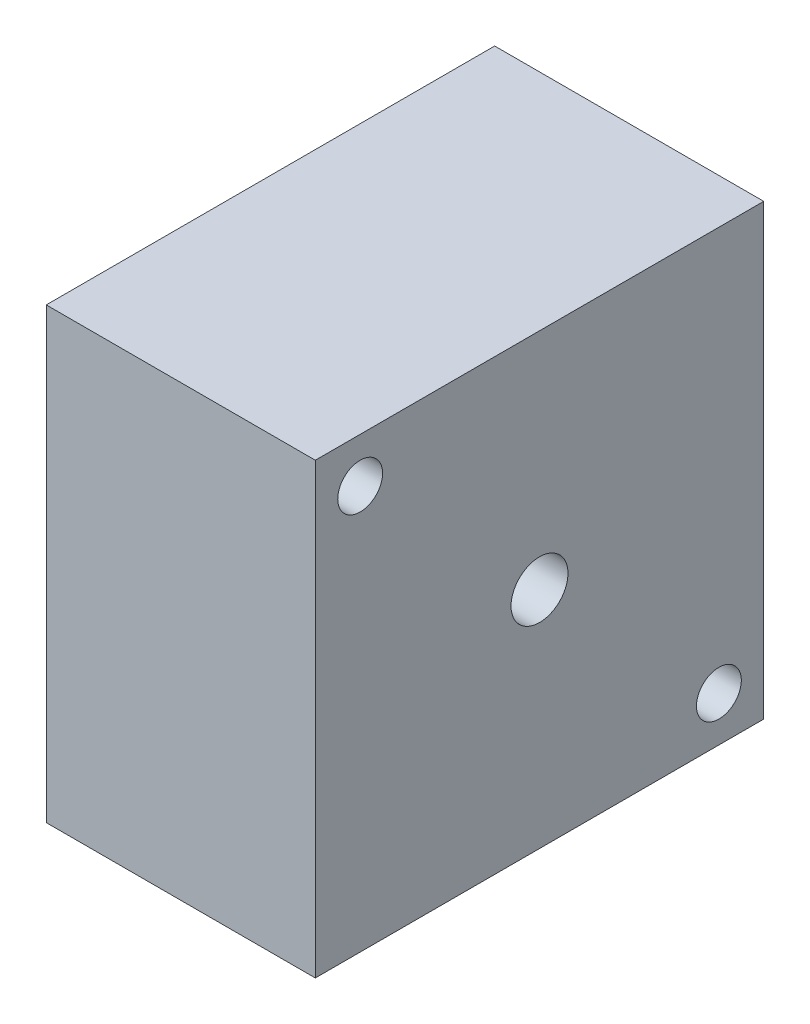
ISO-10303-21;
HEADER;
FILE_DESCRIPTION(('STEP AP214'),'2;1');
FILE_NAME('part.step','',(''),(''),'','','');
FILE_SCHEMA(('AUTOMOTIVE_DESIGN { 1 0 10303 214 1 1 1 1 }'));
ENDSEC;
DATA;
#1=APPLICATION_CONTEXT('core data for automotive mechanical design processes');
#2=APPLICATION_PROTOCOL_DEFINITION('international standard','automotive_design',2000,#1);
#3=PRODUCT_CONTEXT('',#1,'mechanical');
#4=PRODUCT('Part','Part','',(#3));
#5=PRODUCT_RELATED_PRODUCT_CATEGORY('part','',(#4));
#6=PRODUCT_DEFINITION_FORMATION('','',#4);
#7=PRODUCT_DEFINITION_CONTEXT('part definition',#1,'design');
#8=PRODUCT_DEFINITION('design','',#6,#7);
#9=PRODUCT_DEFINITION_SHAPE('','',#8);
#10=(LENGTH_UNIT() NAMED_UNIT(*) SI_UNIT(.MILLI.,.METRE.));
#11=(NAMED_UNIT(*) PLANE_ANGLE_UNIT() SI_UNIT($,.RADIAN.));
#12=(NAMED_UNIT(*) SI_UNIT($,.STERADIAN.) SOLID_ANGLE_UNIT());
#13=UNCERTAINTY_MEASURE_WITH_UNIT(LENGTH_MEASURE(1.E-05),#10,'distance_accuracy_value','');
#14=(GEOMETRIC_REPRESENTATION_CONTEXT(3) GLOBAL_UNCERTAINTY_ASSIGNED_CONTEXT((#13)) GLOBAL_UNIT_ASSIGNED_CONTEXT((#10,
#11,#12)) REPRESENTATION_CONTEXT('',''));
#15=CARTESIAN_POINT('',(0.,0.,0.));
#16=DIRECTION('',(0.,0.,1.));
#17=DIRECTION('',(1.,0.,0.));
#18=AXIS2_PLACEMENT_3D('',#15,#16,#17);
#19=CARTESIAN_POINT('',(30.,50.,0.));
#20=DIRECTION('',(-1.,0.,0.));
#21=DIRECTION('',(0.,0.,1.));
#22=AXIS2_PLACEMENT_3D('',#19,#20,#21);
#23=PLANE('',#22);
#24=CARTESIAN_POINT('',(30.,5.00000000000007,-45.0000000000001));
#25=DIRECTION('',(-1.,0.,0.));
#26=DIRECTION('',(0.,0.,1.));
#27=AXIS2_PLACEMENT_3D('',#24,#25,#26);
#28=CIRCLE('',#27,2.5);
#29=CARTESIAN_POINT('',(30.,5.00000000000007,-42.5000000000001));
#30=VERTEX_POINT('',#29);
#31=EDGE_CURVE('E113',#30,#30,#28,.F.);
#32=ORIENTED_EDGE('',*,*,#31,.F.);
#33=EDGE_LOOP('',(#32));
#34=FACE_BOUND('',#33,.T.);
#35=DIRECTION('',(0.,-1.,0.));
#36=VECTOR('',#35,1.);
#37=CARTESIAN_POINT('',(30.,0.,0.));
#38=LINE('',#37,#36);
#39=CARTESIAN_POINT('',(30.,50.,0.));
#40=VERTEX_POINT('',#39);
#41=CARTESIAN_POINT('',(30.,0.,0.));
#42=VERTEX_POINT('',#41);
#43=EDGE_CURVE('E89',#40,#42,#38,.T.);
#44=ORIENTED_EDGE('',*,*,#43,.T.);
#45=DIRECTION('',(0.,0.,-1.));
#46=VECTOR('',#45,1.);
#47=CARTESIAN_POINT('',(30.,0.,0.));
#48=LINE('',#47,#46);
#49=CARTESIAN_POINT('',(30.,0.,-50.));
#50=VERTEX_POINT('',#49);
#51=EDGE_CURVE('E84',#42,#50,#48,.T.);
#52=ORIENTED_EDGE('',*,*,#51,.T.);
#53=DIRECTION('',(0.,1.,0.));
#54=VECTOR('',#53,1.);
#55=CARTESIAN_POINT('',(30.,0.,-50.));
#56=LINE('',#55,#54);
#57=CARTESIAN_POINT('',(30.,50.,-50.));
#58=VERTEX_POINT('',#57);
#59=EDGE_CURVE('E87',#50,#58,#56,.T.);
#60=ORIENTED_EDGE('',*,*,#59,.T.);
#61=DIRECTION('',(0.,0.,1.));
#62=VECTOR('',#61,1.);
#63=CARTESIAN_POINT('',(30.,50.,0.));
#64=LINE('',#63,#62);
#65=EDGE_CURVE('E54',#58,#40,#64,.T.);
#66=ORIENTED_EDGE('',*,*,#65,.T.);
#67=EDGE_LOOP('',(#44,#52,#60,#66));
#68=FACE_BOUND('',#67,.T.);
#69=CARTESIAN_POINT('',(30.,25.,-25.0000000000005));
#70=DIRECTION('',(-1.,0.,0.));
#71=DIRECTION('',(0.,0.,1.));
#72=AXIS2_PLACEMENT_3D('',#69,#70,#71);
#73=CIRCLE('',#72,3.175);
#74=CARTESIAN_POINT('',(30.,25.,-21.8250000000005));
#75=VERTEX_POINT('',#74);
#76=EDGE_CURVE('E105',#75,#75,#73,.F.);
#77=ORIENTED_EDGE('',*,*,#76,.F.);
#78=EDGE_LOOP('',(#77));
#79=FACE_BOUND('',#78,.T.);
#80=CARTESIAN_POINT('',(30.,45.,-5.00000000000006));
#81=DIRECTION('',(-1.,0.,0.));
#82=DIRECTION('',(0.,0.,1.));
#83=AXIS2_PLACEMENT_3D('',#80,#81,#82);
#84=CIRCLE('',#83,2.5);
#85=CARTESIAN_POINT('',(30.,47.4855372886238,-4.7314773997207));
#86=VERTEX_POINT('',#85);
#87=EDGE_CURVE('E116',#86,#86,#84,.F.);
#88=ORIENTED_EDGE('',*,*,#87,.F.);
#89=EDGE_LOOP('',(#88));
#90=FACE_BOUND('',#89,.T.);
#91=ADVANCED_FACE('F35',(#34,#68,#79,#90),#23,.F.);
#92=CARTESIAN_POINT('',(0.,50.,0.));
#93=DIRECTION('',(-1.,0.,0.));
#94=DIRECTION('',(0.,0.,1.));
#95=AXIS2_PLACEMENT_3D('',#92,#93,#94);
#96=PLANE('',#95);
#97=CARTESIAN_POINT('',(0.,5.00000000000007,-45.0000000000001));
#98=DIRECTION('',(-1.,0.,0.));
#99=DIRECTION('',(0.,0.,1.));
#100=AXIS2_PLACEMENT_3D('',#97,#98,#99);
#101=CIRCLE('',#100,2.5);
#102=CARTESIAN_POINT('',(0.,5.00000000000007,-42.5000000000001));
#103=VERTEX_POINT('',#102);
#104=EDGE_CURVE('E114',#103,#103,#101,.F.);
#105=ORIENTED_EDGE('',*,*,#104,.T.);
#106=EDGE_LOOP('',(#105));
#107=FACE_BOUND('',#106,.T.);
#108=DIRECTION('',(0.,-1.,0.));
#109=VECTOR('',#108,1.);
#110=CARTESIAN_POINT('',(0.,0.,0.));
#111=LINE('',#110,#109);
#112=CARTESIAN_POINT('',(0.,50.,0.));
#113=VERTEX_POINT('',#112);
#114=CARTESIAN_POINT('',(0.,0.,0.));
#115=VERTEX_POINT('',#114);
#116=EDGE_CURVE('E102',#113,#115,#111,.T.);
#117=ORIENTED_EDGE('',*,*,#116,.F.);
#118=DIRECTION('',(0.,0.,1.));
#119=VECTOR('',#118,1.);
#120=CARTESIAN_POINT('',(0.,50.,0.));
#121=LINE('',#120,#119);
#122=CARTESIAN_POINT('',(0.,50.,-50.));
#123=VERTEX_POINT('',#122);
#124=EDGE_CURVE('E77',#123,#113,#121,.T.);
#125=ORIENTED_EDGE('',*,*,#124,.F.);
#126=DIRECTION('',(0.,1.,0.));
#127=VECTOR('',#126,1.);
#128=CARTESIAN_POINT('',(0.,0.,-50.));
#129=LINE('',#128,#127);
#130=CARTESIAN_POINT('',(0.,0.,-50.));
#131=VERTEX_POINT('',#130);
#132=EDGE_CURVE('E71',#131,#123,#129,.T.);
#133=ORIENTED_EDGE('',*,*,#132,.F.);
#134=DIRECTION('',(0.,0.,-1.));
#135=VECTOR('',#134,1.);
#136=CARTESIAN_POINT('',(0.,0.,0.));
#137=LINE('',#136,#135);
#138=EDGE_CURVE('E93',#115,#131,#137,.T.);
#139=ORIENTED_EDGE('',*,*,#138,.F.);
#140=EDGE_LOOP('',(#117,#125,#133,#139));
#141=FACE_BOUND('',#140,.T.);
#142=CARTESIAN_POINT('',(0.,25.,-25.0000000000003));
#143=DIRECTION('',(-1.,0.,0.));
#144=DIRECTION('',(0.,0.,1.));
#145=AXIS2_PLACEMENT_3D('',#142,#143,#144);
#146=CIRCLE('',#145,3.175);
#147=CARTESIAN_POINT('',(0.,25.,-21.8250000000003));
#148=VERTEX_POINT('',#147);
#149=EDGE_CURVE('E111',#148,#148,#146,.F.);
#150=ORIENTED_EDGE('',*,*,#149,.T.);
#151=EDGE_LOOP('',(#150));
#152=FACE_BOUND('',#151,.T.);
#153=CARTESIAN_POINT('',(0.,45.,-5.00000000000006));
#154=DIRECTION('',(-1.,0.,0.));
#155=DIRECTION('',(0.,0.,1.));
#156=AXIS2_PLACEMENT_3D('',#153,#154,#155);
#157=CIRCLE('',#156,2.5);
#158=CARTESIAN_POINT('',(0.,47.4855372886238,-4.73147739972069));
#159=VERTEX_POINT('',#158);
#160=EDGE_CURVE('E39',#159,#159,#157,.F.);
#161=ORIENTED_EDGE('',*,*,#160,.T.);
#162=EDGE_LOOP('',(#161));
#163=FACE_BOUND('',#162,.T.);
#164=ADVANCED_FACE('F133',(#107,#141,#152,#163),#96,.T.);
#165=CARTESIAN_POINT('',(30.,0.,0.));
#166=DIRECTION('',(0.,0.,-1.));
#167=DIRECTION('',(-1.,0.,0.));
#168=AXIS2_PLACEMENT_3D('',#165,#166,#167);
#169=PLANE('',#168);
#170=ORIENTED_EDGE('',*,*,#116,.T.);
#171=DIRECTION('',(-1.,0.,0.));
#172=VECTOR('',#171,1.);
#173=CARTESIAN_POINT('',(30.,0.,0.));
#174=LINE('',#173,#172);
#175=EDGE_CURVE('E11',#42,#115,#174,.T.);
#176=ORIENTED_EDGE('',*,*,#175,.F.);
#177=ORIENTED_EDGE('',*,*,#43,.F.);
#178=DIRECTION('',(-1.,0.,0.));
#179=VECTOR('',#178,1.);
#180=CARTESIAN_POINT('',(30.,50.,0.));
#181=LINE('',#180,#179);
#182=EDGE_CURVE('E98',#40,#113,#181,.T.);
#183=ORIENTED_EDGE('',*,*,#182,.T.);
#184=EDGE_LOOP('',(#170,#176,#177,#183));
#185=FACE_BOUND('',#184,.T.);
#186=ADVANCED_FACE('F37',(#185),#169,.F.);
#187=CARTESIAN_POINT('',(30.,0.,0.));
#188=DIRECTION('',(0.,1.,0.));
#189=DIRECTION('',(0.,0.,1.));
#190=AXIS2_PLACEMENT_3D('',#187,#188,#189);
#191=PLANE('',#190);
#192=ORIENTED_EDGE('',*,*,#138,.T.);
#193=DIRECTION('',(-1.,0.,0.));
#194=VECTOR('',#193,1.);
#195=CARTESIAN_POINT('',(30.,0.,-50.));
#196=LINE('',#195,#194);
#197=EDGE_CURVE('E45',#50,#131,#196,.T.);
#198=ORIENTED_EDGE('',*,*,#197,.F.);
#199=ORIENTED_EDGE('',*,*,#51,.F.);
#200=ORIENTED_EDGE('',*,*,#175,.T.);
#201=EDGE_LOOP('',(#192,#198,#199,#200));
#202=FACE_BOUND('',#201,.T.);
#203=ADVANCED_FACE('F92',(#202),#191,.F.);
#204=CARTESIAN_POINT('',(30.,0.,-50.));
#205=DIRECTION('',(0.,0.,1.));
#206=DIRECTION('',(1.,0.,0.));
#207=AXIS2_PLACEMENT_3D('',#204,#205,#206);
#208=PLANE('',#207);
#209=ORIENTED_EDGE('',*,*,#132,.T.);
#210=DIRECTION('',(-1.,0.,0.));
#211=VECTOR('',#210,1.);
#212=CARTESIAN_POINT('',(30.,50.,-50.));
#213=LINE('',#212,#211);
#214=EDGE_CURVE('E94',#58,#123,#213,.T.);
#215=ORIENTED_EDGE('',*,*,#214,.F.);
#216=ORIENTED_EDGE('',*,*,#59,.F.);
#217=ORIENTED_EDGE('',*,*,#197,.T.);
#218=EDGE_LOOP('',(#209,#215,#216,#217));
#219=FACE_BOUND('',#218,.T.);
#220=ADVANCED_FACE('F96',(#219),#208,.F.);
#221=CARTESIAN_POINT('',(30.,50.,0.));
#222=DIRECTION('',(0.,-1.,0.));
#223=DIRECTION('',(0.,0.,-1.));
#224=AXIS2_PLACEMENT_3D('',#221,#222,#223);
#225=PLANE('',#224);
#226=ORIENTED_EDGE('',*,*,#124,.T.);
#227=ORIENTED_EDGE('',*,*,#182,.F.);
#228=ORIENTED_EDGE('',*,*,#65,.F.);
#229=ORIENTED_EDGE('',*,*,#214,.T.);
#230=EDGE_LOOP('',(#226,#227,#228,#229));
#231=FACE_BOUND('',#230,.T.);
#232=ADVANCED_FACE('F144',(#231),#225,.F.);
#233=CARTESIAN_POINT('',(-23.4630809985406,25.,-25.0000000000001));
#234=DIRECTION('',(1.,0.,0.));
#235=DIRECTION('',(0.,0.438373475942388,-0.898792910291458));
#236=AXIS2_PLACEMENT_3D('',#233,#234,#235);
#237=CYLINDRICAL_SURFACE('',#236,3.175);
#238=ORIENTED_EDGE('',*,*,#149,.F.);
#239=EDGE_LOOP('',(#238));
#240=FACE_BOUND('',#239,.T.);
#241=ORIENTED_EDGE('',*,*,#76,.T.);
#242=EDGE_LOOP('',(#241));
#243=FACE_BOUND('',#242,.T.);
#244=ADVANCED_FACE('F130',(#240,#243),#237,.F.);
#245=CARTESIAN_POINT('',(-56.4081609985396,5.00000000000007,-45.0000000000001));
#246=DIRECTION('',(1.,0.,0.));
#247=DIRECTION('',(0.,-0.0752927382838369,-0.99716147316356));
#248=AXIS2_PLACEMENT_3D('',#245,#246,#247);
#249=CYLINDRICAL_SURFACE('',#248,2.5);
#250=ORIENTED_EDGE('',*,*,#104,.F.);
#251=EDGE_LOOP('',(#250));
#252=FACE_BOUND('',#251,.T.);
#253=ORIENTED_EDGE('',*,*,#31,.T.);
#254=EDGE_LOOP('',(#253));
#255=FACE_BOUND('',#254,.T.);
#256=ADVANCED_FACE('F164',(#252,#255),#249,.F.);
#257=CARTESIAN_POINT('',(-56.4081609985406,45.,-5.00000000000004));
#258=DIRECTION('',(1.,0.,0.));
#259=DIRECTION('',(0.,0.994214915449508,0.107409040111746));
#260=AXIS2_PLACEMENT_3D('',#257,#258,#259);
#261=CYLINDRICAL_SURFACE('',#260,2.5);
#262=CARTESIAN_POINT('',(0.,47.4855372886238,-4.73147739972069));
#263=CARTESIAN_POINT('',(0.312500000000008,47.4855372886238,-4.73147739972069));
#264=CARTESIAN_POINT('',(0.625000000000008,47.4855372886238,-4.73147739972069));
#265=CARTESIAN_POINT('',(1.25000000000001,47.4855372886238,-4.73147739972069));
#266=CARTESIAN_POINT('',(1.56250000000001,47.4855372886238,-4.73147739972069));
#267=CARTESIAN_POINT('',(2.18750000000001,47.4855372886238,-4.73147739972069));
#268=CARTESIAN_POINT('',(2.50000000000001,47.4855372886238,-4.73147739972069));
#269=CARTESIAN_POINT('',(3.12500000000001,47.4855372886238,-4.73147739972069));
#270=CARTESIAN_POINT('',(3.43750000000001,47.4855372886238,-4.73147739972069));
#271=CARTESIAN_POINT('',(4.06250000000001,47.4855372886238,-4.73147739972069));
#272=CARTESIAN_POINT('',(4.37500000000001,47.4855372886238,-4.73147739972069));
#273=CARTESIAN_POINT('',(5.,47.4855372886238,-4.73147739972069));
#274=CARTESIAN_POINT('',(5.3125,47.4855372886238,-4.7314773997207));
#275=CARTESIAN_POINT('',(5.9375,47.4855372886238,-4.7314773997207));
#276=CARTESIAN_POINT('',(6.25,47.4855372886238,-4.7314773997207));
#277=CARTESIAN_POINT('',(6.875,47.4855372886238,-4.7314773997207));
#278=CARTESIAN_POINT('',(7.1875,47.4855372886238,-4.7314773997207));
#279=CARTESIAN_POINT('',(7.81250000000001,47.4855372886238,-4.7314773997207));
#280=CARTESIAN_POINT('',(8.125,47.4855372886238,-4.7314773997207));
#281=CARTESIAN_POINT('',(8.75,47.4855372886238,-4.7314773997207));
#282=CARTESIAN_POINT('',(9.0625,47.4855372886238,-4.7314773997207));
#283=CARTESIAN_POINT('',(9.6875,47.4855372886238,-4.7314773997207));
#284=CARTESIAN_POINT('',(10.,47.4855372886238,-4.7314773997207));
#285=CARTESIAN_POINT('',(10.625,47.4855372886238,-4.7314773997207));
#286=CARTESIAN_POINT('',(10.9375,47.4855372886238,-4.7314773997207));
#287=CARTESIAN_POINT('',(11.5625,47.4855372886238,-4.7314773997207));
#288=CARTESIAN_POINT('',(11.875,47.4855372886238,-4.7314773997207));
#289=CARTESIAN_POINT('',(12.5,47.4855372886238,-4.7314773997207));
#290=CARTESIAN_POINT('',(12.8125,47.4855372886238,-4.7314773997207));
#291=CARTESIAN_POINT('',(13.4375,47.4855372886238,-4.7314773997207));
#292=CARTESIAN_POINT('',(13.75,47.4855372886238,-4.7314773997207));
#293=CARTESIAN_POINT('',(14.375,47.4855372886238,-4.7314773997207));
#294=CARTESIAN_POINT('',(14.6875,47.4855372886238,-4.7314773997207));
#295=CARTESIAN_POINT('',(15.3125,47.4855372886238,-4.7314773997207));
#296=CARTESIAN_POINT('',(15.625,47.4855372886238,-4.7314773997207));
#297=CARTESIAN_POINT('',(16.25,47.4855372886238,-4.7314773997207));
#298=CARTESIAN_POINT('',(16.5625,47.4855372886238,-4.7314773997207));
#299=CARTESIAN_POINT('',(17.1875,47.4855372886238,-4.7314773997207));
#300=CARTESIAN_POINT('',(17.5,47.4855372886238,-4.7314773997207));
#301=CARTESIAN_POINT('',(18.125,47.4855372886238,-4.7314773997207));
#302=CARTESIAN_POINT('',(18.4375,47.4855372886238,-4.7314773997207));
#303=CARTESIAN_POINT('',(19.0625,47.4855372886238,-4.7314773997207));
#304=CARTESIAN_POINT('',(19.375,47.4855372886238,-4.7314773997207));
#305=CARTESIAN_POINT('',(20.,47.4855372886238,-4.7314773997207));
#306=CARTESIAN_POINT('',(20.3125,47.4855372886238,-4.7314773997207));
#307=CARTESIAN_POINT('',(20.9375,47.4855372886238,-4.7314773997207));
#308=CARTESIAN_POINT('',(21.25,47.4855372886238,-4.7314773997207));
#309=CARTESIAN_POINT('',(21.875,47.4855372886238,-4.7314773997207));
#310=CARTESIAN_POINT('',(22.1875,47.4855372886238,-4.7314773997207));
#311=CARTESIAN_POINT('',(22.8125,47.4855372886238,-4.7314773997207));
#312=CARTESIAN_POINT('',(23.125,47.4855372886238,-4.7314773997207));
#313=CARTESIAN_POINT('',(23.75,47.4855372886238,-4.7314773997207));
#314=CARTESIAN_POINT('',(24.0625,47.4855372886238,-4.7314773997207));
#315=CARTESIAN_POINT('',(24.6875,47.4855372886238,-4.7314773997207));
#316=CARTESIAN_POINT('',(25.,47.4855372886238,-4.7314773997207));
#317=CARTESIAN_POINT('',(25.625,47.4855372886238,-4.7314773997207));
#318=CARTESIAN_POINT('',(25.9375,47.4855372886238,-4.7314773997207));
#319=CARTESIAN_POINT('',(26.5625,47.4855372886238,-4.7314773997207));
#320=CARTESIAN_POINT('',(26.875,47.4855372886238,-4.7314773997207));
#321=CARTESIAN_POINT('',(27.5,47.4855372886238,-4.7314773997207));
#322=CARTESIAN_POINT('',(27.8125,47.4855372886238,-4.7314773997207));
#323=CARTESIAN_POINT('',(28.4375,47.4855372886238,-4.7314773997207));
#324=CARTESIAN_POINT('',(28.75,47.4855372886238,-4.7314773997207));
#325=CARTESIAN_POINT('',(29.375,47.4855372886238,-4.7314773997207));
#326=CARTESIAN_POINT('',(29.6875,47.4855372886238,-4.7314773997207));
#327=CARTESIAN_POINT('',(30.,47.4855372886238,-4.7314773997207));
#328=B_SPLINE_CURVE_WITH_KNOTS('',3,(#262,#263,#264,#265,#266,#267,#268,#269,#270,#271,#272,
#273,#274,#275,#276,#277,#278,#279,#280,#281,#282,#283,#284,#285,#286,#287,#288,#289,#290,#291,
#292,#293,#294,#295,#296,#297,#298,#299,#300,#301,#302,#303,#304,#305,#306,#307,#308,#309,#310,
#311,#312,#313,#314,#315,#316,#317,#318,#319,#320,#321,#322,#323,#324,#325,#326,#327),
.UNSPECIFIED.,.F.,.F.,(4,2,2,2,2,2,2,2,2,2,2,2,2,2,2,2,2,2,2,2,2,2,2,2,2,2,2,2,2,2,2,2,4),(0.,
0.937500000000001,1.875,2.8125,3.75,4.6875,5.625,6.56249999999999,7.5,8.43749999999999,
9.37499999999999,10.3125,11.25,12.1875,13.125,14.0625,15.,15.9375,16.875,17.8125,18.75,19.6875,
20.625,21.5625,22.5,23.4375,24.375,25.3125,26.25,27.1875,28.125,29.0625,30.),.UNSPECIFIED.);
#329=EDGE_CURVE('BSEAM162',#159,#86,#328,.T.);
#330=ORIENTED_EDGE('',*,*,#160,.F.);
#331=ORIENTED_EDGE('',*,*,#87,.T.);
#332=ORIENTED_EDGE('',*,*,#329,.T.);
#333=ORIENTED_EDGE('',*,*,#329,.F.);
#334=EDGE_LOOP('',(#330,#332,#331,#333));
#335=FACE_BOUND('',#334,.T.);
#336=ADVANCED_FACE('F162',(#335),#261,.F.);
#337=CLOSED_SHELL('',(#91,#164,#186,#203,#220,#232,#244,#256,#336));
#338=MANIFOLD_SOLID_BREP('B2',#337);
#339=ADVANCED_BREP_SHAPE_REPRESENTATION('',(#18,#338),#14);
#340=SHAPE_DEFINITION_REPRESENTATION(#9,#339);
ENDSEC;
END-ISO-10303-21;
